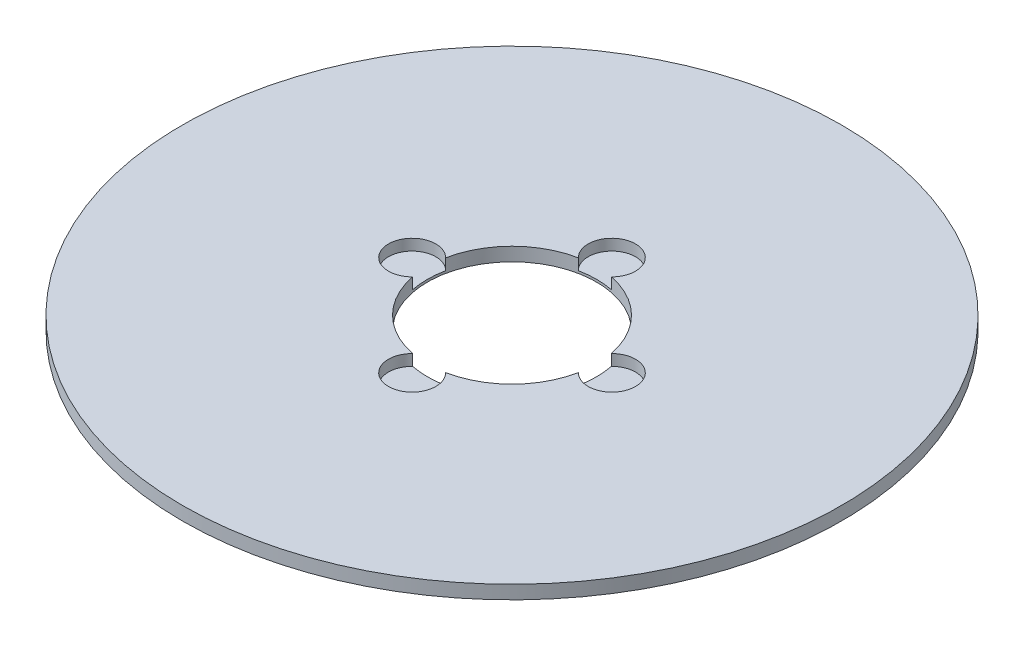
ISO-10303-21;
HEADER;
FILE_DESCRIPTION(('STEP AP214'),'2;1');
FILE_NAME('part.step','',(''),(''),'','','');
FILE_SCHEMA(('AUTOMOTIVE_DESIGN { 1 0 10303 214 1 1 1 1 }'));
ENDSEC;
DATA;
#1=APPLICATION_CONTEXT('core data for automotive mechanical design processes');
#2=APPLICATION_PROTOCOL_DEFINITION('international standard','automotive_design',2000,#1);
#3=PRODUCT_CONTEXT('',#1,'mechanical');
#4=PRODUCT('Part','Part','',(#3));
#5=PRODUCT_RELATED_PRODUCT_CATEGORY('part','',(#4));
#6=PRODUCT_DEFINITION_FORMATION('','',#4);
#7=PRODUCT_DEFINITION_CONTEXT('part definition',#1,'design');
#8=PRODUCT_DEFINITION('design','',#6,#7);
#9=PRODUCT_DEFINITION_SHAPE('','',#8);
#10=(LENGTH_UNIT() NAMED_UNIT(*) SI_UNIT(.MILLI.,.METRE.));
#11=(NAMED_UNIT(*) PLANE_ANGLE_UNIT() SI_UNIT($,.RADIAN.));
#12=(NAMED_UNIT(*) SI_UNIT($,.STERADIAN.) SOLID_ANGLE_UNIT());
#13=UNCERTAINTY_MEASURE_WITH_UNIT(LENGTH_MEASURE(1.E-05),#10,'distance_accuracy_value','');
#14=(GEOMETRIC_REPRESENTATION_CONTEXT(3) GLOBAL_UNCERTAINTY_ASSIGNED_CONTEXT((#13)) GLOBAL_UNIT_ASSIGNED_CONTEXT((#10,
#11,#12)) REPRESENTATION_CONTEXT('',''));
#15=CARTESIAN_POINT('',(0.,0.,0.));
#16=DIRECTION('',(0.,0.,1.));
#17=DIRECTION('',(1.,0.,0.));
#18=AXIS2_PLACEMENT_3D('',#15,#16,#17);
#19=CARTESIAN_POINT('',(0.,4.,0.));
#20=DIRECTION('',(0.,-1.,0.));
#21=DIRECTION('',(0.,0.,-1.));
#22=AXIS2_PLACEMENT_3D('',#19,#20,#21);
#23=CYLINDRICAL_SURFACE('',#22,97.5);
#24=CARTESIAN_POINT('',(0.,4.,0.));
#25=DIRECTION('',(0.,1.,0.));
#26=DIRECTION('',(0.,0.,1.));
#27=AXIS2_PLACEMENT_3D('',#24,#25,#26);
#28=CIRCLE('',#27,97.5);
#29=CARTESIAN_POINT('',(0.,4.,97.5));
#30=VERTEX_POINT('',#29);
#31=EDGE_CURVE('E145',#30,#30,#28,.T.);
#32=ORIENTED_EDGE('',*,*,#31,.F.);
#33=EDGE_LOOP('',(#32));
#34=FACE_BOUND('',#33,.T.);
#35=CARTESIAN_POINT('',(0.,0.,0.));
#36=DIRECTION('',(0.,1.,0.));
#37=DIRECTION('',(0.,0.,1.));
#38=AXIS2_PLACEMENT_3D('',#35,#36,#37);
#39=CIRCLE('',#38,97.5);
#40=CARTESIAN_POINT('',(0.,0.,97.5));
#41=VERTEX_POINT('',#40);
#42=EDGE_CURVE('E143',#41,#41,#39,.T.);
#43=ORIENTED_EDGE('',*,*,#42,.T.);
#44=EDGE_LOOP('',(#43));
#45=FACE_BOUND('',#44,.T.);
#46=ADVANCED_FACE('F39',(#34,#45),#23,.T.);
#47=CARTESIAN_POINT('',(0.,4.,0.));
#48=DIRECTION('',(0.,1.,0.));
#49=DIRECTION('',(0.,0.,1.));
#50=AXIS2_PLACEMENT_3D('',#47,#48,#49);
#51=PLANE('',#50);
#52=CARTESIAN_POINT('',(1.03139998148187E-13,4.,29.5404695424668));
#53=DIRECTION('',(0.,1.,0.));
#54=DIRECTION('',(1.,0.,0.));
#55=AXIS2_PLACEMENT_3D('',#52,#53,#54);
#56=CIRCLE('',#55,7.00008920204892);
#57=CARTESIAN_POINT('',(-4.87766589930039,4.,24.5195508803649));
#58=VERTEX_POINT('',#57);
#59=CARTESIAN_POINT('',(4.87766589930056,4.,24.5195508803648));
#60=VERTEX_POINT('',#59);
#61=EDGE_CURVE('E152',#58,#60,#56,.T.);
#62=ORIENTED_EDGE('',*,*,#61,.F.);
#63=CARTESIAN_POINT('',(0.,4.,0.));
#64=DIRECTION('',(0.,1.,0.));
#65=DIRECTION('',(0.,0.,1.));
#66=AXIS2_PLACEMENT_3D('',#63,#64,#65);
#67=CIRCLE('',#66,25.);
#68=CARTESIAN_POINT('',(-24.5195508803649,4.,4.87766589930047));
#69=VERTEX_POINT('',#68);
#70=EDGE_CURVE('E133',#69,#58,#67,.T.);
#71=ORIENTED_EDGE('',*,*,#70,.F.);
#72=CARTESIAN_POINT('',(-29.5404695424668,4.,0.));
#73=DIRECTION('',(0.,1.,0.));
#74=DIRECTION('',(0.,0.,1.));
#75=AXIS2_PLACEMENT_3D('',#72,#73,#74);
#76=CIRCLE('',#75,7.00008920204892);
#77=CARTESIAN_POINT('',(-24.5195508803649,4.,-4.87766589930047));
#78=VERTEX_POINT('',#77);
#79=EDGE_CURVE('E128',#78,#69,#76,.T.);
#80=ORIENTED_EDGE('',*,*,#79,.F.);
#81=CARTESIAN_POINT('',(-4.87766589930073,4.,-24.5195508803648));
#82=VERTEX_POINT('',#81);
#83=EDGE_CURVE('E121',#82,#78,#67,.T.);
#84=ORIENTED_EDGE('',*,*,#83,.F.);
#85=CARTESIAN_POINT('',(-3.0941999444456E-13,4.,-29.5404695424668));
#86=DIRECTION('',(0.,1.,0.));
#87=DIRECTION('',(-1.,0.,0.));
#88=AXIS2_PLACEMENT_3D('',#85,#86,#87);
#89=CIRCLE('',#88,7.00008920204892);
#90=CARTESIAN_POINT('',(4.87766589930022,4.,-24.5195508803649));
#91=VERTEX_POINT('',#90);
#92=EDGE_CURVE('E105',#91,#82,#89,.T.);
#93=ORIENTED_EDGE('',*,*,#92,.F.);
#94=CARTESIAN_POINT('',(24.5195508803649,4.,-4.87766589930047));
#95=VERTEX_POINT('',#94);
#96=EDGE_CURVE('E131',#95,#91,#67,.T.);
#97=ORIENTED_EDGE('',*,*,#96,.F.);
#98=CARTESIAN_POINT('',(29.5404695424668,4.,0.));
#99=DIRECTION('',(0.,1.,0.));
#100=DIRECTION('',(0.,0.,-1.));
#101=AXIS2_PLACEMENT_3D('',#98,#99,#100);
#102=CIRCLE('',#101,7.00008920204892);
#103=CARTESIAN_POINT('',(24.5195508803649,4.,4.87766589930047));
#104=VERTEX_POINT('',#103);
#105=EDGE_CURVE('E154',#104,#95,#102,.T.);
#106=ORIENTED_EDGE('',*,*,#105,.F.);
#107=EDGE_CURVE('E134',#60,#104,#67,.T.);
#108=ORIENTED_EDGE('',*,*,#107,.F.);
#109=EDGE_LOOP('',(#62,#71,#80,#84,#93,#97,#106,#108));
#110=FACE_BOUND('',#109,.T.);
#111=ORIENTED_EDGE('',*,*,#31,.T.);
#112=EDGE_LOOP('',(#111));
#113=FACE_BOUND('',#112,.T.);
#114=ADVANCED_FACE('F130',(#110,#113),#51,.T.);
#115=CARTESIAN_POINT('',(0.,0.,0.));
#116=DIRECTION('',(0.,1.,0.));
#117=DIRECTION('',(0.,0.,1.));
#118=AXIS2_PLACEMENT_3D('',#115,#116,#117);
#119=PLANE('',#118);
#120=CARTESIAN_POINT('',(0.,0.,0.));
#121=DIRECTION('',(0.,1.,0.));
#122=DIRECTION('',(0.,0.,1.));
#123=AXIS2_PLACEMENT_3D('',#120,#121,#122);
#124=CIRCLE('',#123,25.);
#125=CARTESIAN_POINT('',(0.,0.,25.));
#126=VERTEX_POINT('',#125);
#127=EDGE_CURVE('E135',#126,#126,#124,.T.);
#128=ORIENTED_EDGE('',*,*,#127,.T.);
#129=EDGE_LOOP('',(#128));
#130=FACE_BOUND('',#129,.T.);
#131=ORIENTED_EDGE('',*,*,#42,.F.);
#132=EDGE_LOOP('',(#131));
#133=FACE_BOUND('',#132,.T.);
#134=ADVANCED_FACE('F195',(#130,#133),#119,.F.);
#135=CARTESIAN_POINT('',(0.,4.,0.));
#136=DIRECTION('',(0.,-1.,0.));
#137=DIRECTION('',(0.,0.,-1.));
#138=AXIS2_PLACEMENT_3D('',#135,#136,#137);
#139=CYLINDRICAL_SURFACE('',#138,25.);
#140=DIRECTION('',(0.,1.,0.));
#141=VECTOR('',#140,1.);
#142=CARTESIAN_POINT('',(-4.87766589930039,2.35394187882352,24.5195508803649));
#143=LINE('',#142,#141);
#144=CARTESIAN_POINT('',(-4.87766589930039,0.70788375764704,24.5195508803649));
#145=VERTEX_POINT('',#144);
#146=EDGE_CURVE('E11',#145,#58,#143,.T.);
#147=ORIENTED_EDGE('',*,*,#146,.F.);
#148=CARTESIAN_POINT('',(0.,0.70788375764704,0.));
#149=DIRECTION('',(0.,1.,0.));
#150=DIRECTION('',(0.,0.,1.));
#151=AXIS2_PLACEMENT_3D('',#148,#149,#150);
#152=CIRCLE('',#151,25.);
#153=CARTESIAN_POINT('',(4.87766589930056,0.70788375764704,24.5195508803648));
#154=VERTEX_POINT('',#153);
#155=EDGE_CURVE('E169',#145,#154,#152,.T.);
#156=ORIENTED_EDGE('',*,*,#155,.T.);
#157=DIRECTION('',(0.,1.,0.));
#158=VECTOR('',#157,1.);
#159=CARTESIAN_POINT('',(4.87766589930056,2.35394187882352,24.5195508803648));
#160=LINE('',#159,#158);
#161=EDGE_CURVE('E46',#60,#154,#160,.F.);
#162=ORIENTED_EDGE('',*,*,#161,.F.);
#163=ORIENTED_EDGE('',*,*,#107,.T.);
#164=DIRECTION('',(0.,1.,0.));
#165=VECTOR('',#164,1.);
#166=CARTESIAN_POINT('',(24.5195508803649,2.35394187882352,4.87766589930047));
#167=LINE('',#166,#165);
#168=CARTESIAN_POINT('',(24.5195508803649,0.70788375764704,4.87766589930047));
#169=VERTEX_POINT('',#168);
#170=EDGE_CURVE('E151',#169,#104,#167,.T.);
#171=ORIENTED_EDGE('',*,*,#170,.F.);
#172=CARTESIAN_POINT('',(0.,0.70788375764704,0.));
#173=DIRECTION('',(0.,1.,0.));
#174=DIRECTION('',(0.,0.,1.));
#175=AXIS2_PLACEMENT_3D('',#172,#173,#174);
#176=CIRCLE('',#175,25.);
#177=CARTESIAN_POINT('',(24.5195508803649,0.70788375764704,-4.87766589930047));
#178=VERTEX_POINT('',#177);
#179=EDGE_CURVE('E173',#169,#178,#176,.T.);
#180=ORIENTED_EDGE('',*,*,#179,.T.);
#181=DIRECTION('',(0.,1.,0.));
#182=VECTOR('',#181,1.);
#183=CARTESIAN_POINT('',(24.5195508803649,2.35394187882352,-4.87766589930047));
#184=LINE('',#183,#182);
#185=EDGE_CURVE('E168',#95,#178,#184,.F.);
#186=ORIENTED_EDGE('',*,*,#185,.F.);
#187=ORIENTED_EDGE('',*,*,#96,.T.);
#188=DIRECTION('',(0.,1.,0.));
#189=VECTOR('',#188,1.);
#190=CARTESIAN_POINT('',(4.87766589930021,2.35394187882352,-24.5195508803649));
#191=LINE('',#190,#189);
#192=CARTESIAN_POINT('',(4.87766589930022,0.70788375764704,-24.5195508803649));
#193=VERTEX_POINT('',#192);
#194=EDGE_CURVE('E108',#193,#91,#191,.T.);
#195=ORIENTED_EDGE('',*,*,#194,.F.);
#196=CARTESIAN_POINT('',(0.,0.70788375764704,0.));
#197=DIRECTION('',(0.,1.,0.));
#198=DIRECTION('',(0.,0.,1.));
#199=AXIS2_PLACEMENT_3D('',#196,#197,#198);
#200=CIRCLE('',#199,25.);
#201=CARTESIAN_POINT('',(-4.87766589930073,0.70788375764704,-24.5195508803648));
#202=VERTEX_POINT('',#201);
#203=EDGE_CURVE('E122',#193,#202,#200,.T.);
#204=ORIENTED_EDGE('',*,*,#203,.T.);
#205=DIRECTION('',(0.,1.,0.));
#206=VECTOR('',#205,1.);
#207=CARTESIAN_POINT('',(-4.87766589930073,2.35394187882352,-24.5195508803648));
#208=LINE('',#207,#206);
#209=EDGE_CURVE('E106',#82,#202,#208,.F.);
#210=ORIENTED_EDGE('',*,*,#209,.F.);
#211=ORIENTED_EDGE('',*,*,#83,.T.);
#212=DIRECTION('',(0.,1.,0.));
#213=VECTOR('',#212,1.);
#214=CARTESIAN_POINT('',(-24.5195508803649,2.35394187882352,-4.87766589930047));
#215=LINE('',#214,#213);
#216=CARTESIAN_POINT('',(-24.5195508803649,0.70788375764704,-4.87766589930047));
#217=VERTEX_POINT('',#216);
#218=EDGE_CURVE('E177',#217,#78,#215,.T.);
#219=ORIENTED_EDGE('',*,*,#218,.F.);
#220=CARTESIAN_POINT('',(0.,0.70788375764704,0.));
#221=DIRECTION('',(0.,1.,0.));
#222=DIRECTION('',(0.,0.,1.));
#223=AXIS2_PLACEMENT_3D('',#220,#221,#222);
#224=CIRCLE('',#223,25.);
#225=CARTESIAN_POINT('',(-24.5195508803649,0.70788375764704,4.87766589930047));
#226=VERTEX_POINT('',#225);
#227=EDGE_CURVE('E185',#217,#226,#224,.T.);
#228=ORIENTED_EDGE('',*,*,#227,.T.);
#229=DIRECTION('',(0.,1.,0.));
#230=VECTOR('',#229,1.);
#231=CARTESIAN_POINT('',(-24.5195508803649,2.35394187882352,4.87766589930047));
#232=LINE('',#231,#230);
#233=EDGE_CURVE('E179',#69,#226,#232,.F.);
#234=ORIENTED_EDGE('',*,*,#233,.F.);
#235=ORIENTED_EDGE('',*,*,#70,.T.);
#236=EDGE_LOOP('',(#147,#156,#162,#163,#171,#180,#186,#187,#195,#204,#210,#211,#219,#228,#234,#235));
#237=FACE_BOUND('',#236,.T.);
#238=ORIENTED_EDGE('',*,*,#127,.F.);
#239=EDGE_LOOP('',(#238));
#240=FACE_BOUND('',#239,.T.);
#241=ADVANCED_FACE('F117',(#237,#240),#139,.F.);
#242=CARTESIAN_POINT('',(-29.5404695424668,0.70788375764704,0.));
#243=DIRECTION('',(0.,1.,0.));
#244=DIRECTION('',(0.,0.,1.));
#245=AXIS2_PLACEMENT_3D('',#242,#243,#244);
#246=CYLINDRICAL_SURFACE('',#245,7.00008920204892);
#247=ORIENTED_EDGE('',*,*,#218,.T.);
#248=ORIENTED_EDGE('',*,*,#79,.T.);
#249=ORIENTED_EDGE('',*,*,#233,.T.);
#250=CARTESIAN_POINT('',(-29.5404695424668,0.70788375764704,0.));
#251=DIRECTION('',(0.,1.,0.));
#252=DIRECTION('',(0.,0.,1.));
#253=AXIS2_PLACEMENT_3D('',#250,#251,#252);
#254=CIRCLE('',#253,7.00008920204892);
#255=EDGE_CURVE('E140',#217,#226,#254,.T.);
#256=ORIENTED_EDGE('',*,*,#255,.F.);
#257=EDGE_LOOP('',(#247,#248,#249,#256));
#258=FACE_BOUND('',#257,.T.);
#259=ADVANCED_FACE('F200',(#258),#246,.F.);
#260=CARTESIAN_POINT('',(-29.5404695424668,0.70788375764704,0.));
#261=DIRECTION('',(0.,1.,0.));
#262=DIRECTION('',(0.,0.,1.));
#263=AXIS2_PLACEMENT_3D('',#260,#261,#262);
#264=PLANE('',#263);
#265=ORIENTED_EDGE('',*,*,#255,.T.);
#266=ORIENTED_EDGE('',*,*,#227,.F.);
#267=EDGE_LOOP('',(#265,#266));
#268=FACE_BOUND('',#267,.T.);
#269=ADVANCED_FACE('F202',(#268),#264,.T.);
#270=CARTESIAN_POINT('',(-3.0941999444456E-13,0.70788375764704,-29.5404695424668));
#271=DIRECTION('',(0.,1.,0.));
#272=DIRECTION('',(0.,0.,1.));
#273=AXIS2_PLACEMENT_3D('',#270,#271,#272);
#274=CYLINDRICAL_SURFACE('',#273,7.00008920204892);
#275=ORIENTED_EDGE('',*,*,#194,.T.);
#276=ORIENTED_EDGE('',*,*,#92,.T.);
#277=ORIENTED_EDGE('',*,*,#209,.T.);
#278=CARTESIAN_POINT('',(-3.0941999444456E-13,0.70788375764704,-29.5404695424668));
#279=DIRECTION('',(0.,1.,0.));
#280=DIRECTION('',(-1.,0.,0.));
#281=AXIS2_PLACEMENT_3D('',#278,#279,#280);
#282=CIRCLE('',#281,7.00008920204892);
#283=EDGE_CURVE('E111',#193,#202,#282,.T.);
#284=ORIENTED_EDGE('',*,*,#283,.F.);
#285=EDGE_LOOP('',(#275,#276,#277,#284));
#286=FACE_BOUND('',#285,.T.);
#287=ADVANCED_FACE('F102',(#286),#274,.F.);
#288=CARTESIAN_POINT('',(-3.0941999444456E-13,0.70788375764704,-29.5404695424668));
#289=DIRECTION('',(0.,1.,0.));
#290=DIRECTION('',(-1.,0.,0.));
#291=AXIS2_PLACEMENT_3D('',#288,#289,#290);
#292=PLANE('',#291);
#293=ORIENTED_EDGE('',*,*,#283,.T.);
#294=ORIENTED_EDGE('',*,*,#203,.F.);
#295=EDGE_LOOP('',(#293,#294));
#296=FACE_BOUND('',#295,.T.);
#297=ADVANCED_FACE('F211',(#296),#292,.T.);
#298=CARTESIAN_POINT('',(29.5404695424668,0.70788375764704,0.));
#299=DIRECTION('',(0.,1.,0.));
#300=DIRECTION('',(0.,0.,1.));
#301=AXIS2_PLACEMENT_3D('',#298,#299,#300);
#302=CYLINDRICAL_SURFACE('',#301,7.00008920204892);
#303=ORIENTED_EDGE('',*,*,#170,.T.);
#304=ORIENTED_EDGE('',*,*,#105,.T.);
#305=ORIENTED_EDGE('',*,*,#185,.T.);
#306=CARTESIAN_POINT('',(29.5404695424668,0.70788375764704,0.));
#307=DIRECTION('',(0.,1.,0.));
#308=DIRECTION('',(0.,0.,-1.));
#309=AXIS2_PLACEMENT_3D('',#306,#307,#308);
#310=CIRCLE('',#309,7.00008920204892);
#311=EDGE_CURVE('E56',#169,#178,#310,.T.);
#312=ORIENTED_EDGE('',*,*,#311,.F.);
#313=EDGE_LOOP('',(#303,#304,#305,#312));
#314=FACE_BOUND('',#313,.T.);
#315=ADVANCED_FACE('F212',(#314),#302,.F.);
#316=CARTESIAN_POINT('',(29.5404695424668,0.70788375764704,0.));
#317=DIRECTION('',(0.,1.,0.));
#318=DIRECTION('',(0.,0.,-1.));
#319=AXIS2_PLACEMENT_3D('',#316,#317,#318);
#320=PLANE('',#319);
#321=ORIENTED_EDGE('',*,*,#311,.T.);
#322=ORIENTED_EDGE('',*,*,#179,.F.);
#323=EDGE_LOOP('',(#321,#322));
#324=FACE_BOUND('',#323,.T.);
#325=ADVANCED_FACE('F217',(#324),#320,.T.);
#326=CARTESIAN_POINT('',(1.03139998148187E-13,0.70788375764704,29.5404695424668));
#327=DIRECTION('',(0.,1.,0.));
#328=DIRECTION('',(0.,0.,1.));
#329=AXIS2_PLACEMENT_3D('',#326,#327,#328);
#330=CYLINDRICAL_SURFACE('',#329,7.00008920204892);
#331=ORIENTED_EDGE('',*,*,#146,.T.);
#332=ORIENTED_EDGE('',*,*,#61,.T.);
#333=ORIENTED_EDGE('',*,*,#161,.T.);
#334=CARTESIAN_POINT('',(1.03139998148187E-13,0.70788375764704,29.5404695424668));
#335=DIRECTION('',(0.,1.,0.));
#336=DIRECTION('',(1.,0.,0.));
#337=AXIS2_PLACEMENT_3D('',#334,#335,#336);
#338=CIRCLE('',#337,7.00008920204892);
#339=EDGE_CURVE('E55',#145,#154,#338,.T.);
#340=ORIENTED_EDGE('',*,*,#339,.F.);
#341=EDGE_LOOP('',(#331,#332,#333,#340));
#342=FACE_BOUND('',#341,.T.);
#343=ADVANCED_FACE('F170',(#342),#330,.F.);
#344=CARTESIAN_POINT('',(1.03139998148187E-13,0.70788375764704,29.5404695424668));
#345=DIRECTION('',(0.,1.,0.));
#346=DIRECTION('',(1.,0.,0.));
#347=AXIS2_PLACEMENT_3D('',#344,#345,#346);
#348=PLANE('',#347);
#349=ORIENTED_EDGE('',*,*,#339,.T.);
#350=ORIENTED_EDGE('',*,*,#155,.F.);
#351=EDGE_LOOP('',(#349,#350));
#352=FACE_BOUND('',#351,.T.);
#353=ADVANCED_FACE('F224',(#352),#348,.T.);
#354=CLOSED_SHELL('',(#46,#114,#134,#241,#259,#269,#287,#297,#315,#325,#343,#353));
#355=MANIFOLD_SOLID_BREP('B2',#354);
#356=ADVANCED_BREP_SHAPE_REPRESENTATION('',(#18,#355),#14);
#357=SHAPE_DEFINITION_REPRESENTATION(#9,#356);
ENDSEC;
END-ISO-10303-21;
